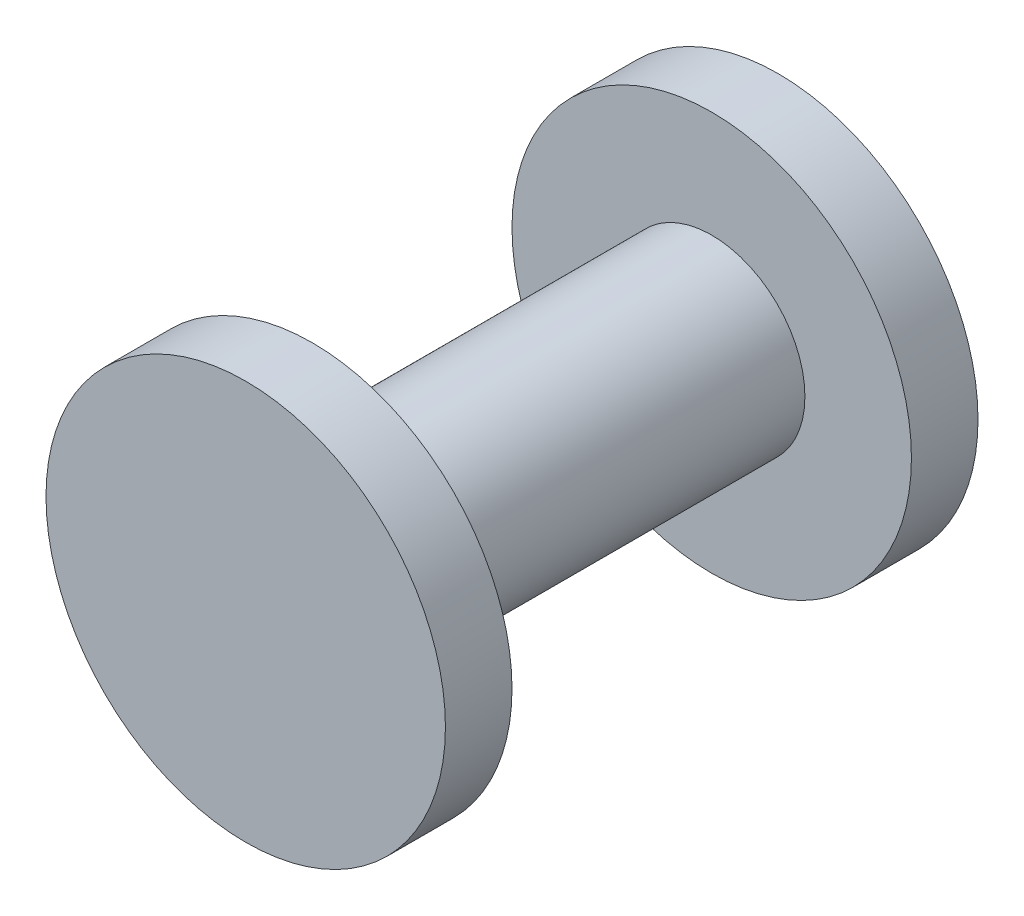
ISO-10303-21;
HEADER;
FILE_DESCRIPTION(('STEP AP214'),'2;1');
FILE_NAME('part.step','',(''),(''),'','','');
FILE_SCHEMA(('AUTOMOTIVE_DESIGN { 1 0 10303 214 1 1 1 1 }'));
ENDSEC;
DATA;
#1=APPLICATION_CONTEXT('core data for automotive mechanical design processes');
#2=APPLICATION_PROTOCOL_DEFINITION('international standard','automotive_design',2000,#1);
#3=PRODUCT_CONTEXT('',#1,'mechanical');
#4=PRODUCT('Part','Part','',(#3));
#5=PRODUCT_RELATED_PRODUCT_CATEGORY('part','',(#4));
#6=PRODUCT_DEFINITION_FORMATION('','',#4);
#7=PRODUCT_DEFINITION_CONTEXT('part definition',#1,'design');
#8=PRODUCT_DEFINITION('design','',#6,#7);
#9=PRODUCT_DEFINITION_SHAPE('','',#8);
#10=(LENGTH_UNIT() NAMED_UNIT(*) SI_UNIT(.MILLI.,.METRE.));
#11=(NAMED_UNIT(*) PLANE_ANGLE_UNIT() SI_UNIT($,.RADIAN.));
#12=(NAMED_UNIT(*) SI_UNIT($,.STERADIAN.) SOLID_ANGLE_UNIT());
#13=UNCERTAINTY_MEASURE_WITH_UNIT(LENGTH_MEASURE(1.E-05),#10,'distance_accuracy_value','');
#14=(GEOMETRIC_REPRESENTATION_CONTEXT(3) GLOBAL_UNCERTAINTY_ASSIGNED_CONTEXT((#13)) GLOBAL_UNIT_ASSIGNED_CONTEXT((#10,
#11,#12)) REPRESENTATION_CONTEXT('',''));
#15=CARTESIAN_POINT('',(0.,0.,0.));
#16=DIRECTION('',(0.,0.,1.));
#17=DIRECTION('',(1.,0.,0.));
#18=AXIS2_PLACEMENT_3D('',#15,#16,#17);
#19=CARTESIAN_POINT('',(0.,0.,0.));
#20=DIRECTION('',(0.,0.,1.));
#21=DIRECTION('',(1.,0.,0.));
#22=AXIS2_PLACEMENT_3D('',#19,#20,#21);
#23=CYLINDRICAL_SURFACE('',#22,14.);
#24=CARTESIAN_POINT('',(0.,0.,10.));
#25=DIRECTION('',(0.,0.,1.));
#26=DIRECTION('',(1.,0.,0.));
#27=AXIS2_PLACEMENT_3D('',#24,#25,#26);
#28=CIRCLE('',#27,14.);
#29=CARTESIAN_POINT('',(14.,0.,10.));
#30=VERTEX_POINT('',#29);
#31=EDGE_CURVE('E46',#30,#30,#28,.T.);
#32=ORIENTED_EDGE('',*,*,#31,.T.);
#33=EDGE_LOOP('',(#32));
#34=FACE_BOUND('',#33,.T.);
#35=CARTESIAN_POINT('',(0.,0.,70.));
#36=DIRECTION('',(0.,0.,1.));
#37=DIRECTION('',(1.,0.,0.));
#38=AXIS2_PLACEMENT_3D('',#35,#36,#37);
#39=CIRCLE('',#38,14.);
#40=CARTESIAN_POINT('',(14.,0.,70.));
#41=VERTEX_POINT('',#40);
#42=EDGE_CURVE('E54',#41,#41,#39,.T.);
#43=ORIENTED_EDGE('',*,*,#42,.F.);
#44=EDGE_LOOP('',(#43));
#45=FACE_BOUND('',#44,.T.);
#46=ADVANCED_FACE('F35',(#34,#45),#23,.T.);
#47=CARTESIAN_POINT('',(0.,0.,10.));
#48=DIRECTION('',(0.,0.,1.));
#49=DIRECTION('',(1.,0.,0.));
#50=AXIS2_PLACEMENT_3D('',#47,#48,#49);
#51=PLANE('',#50);
#52=CARTESIAN_POINT('',(0.,0.,10.));
#53=DIRECTION('',(0.,0.,1.));
#54=DIRECTION('',(1.,0.,0.));
#55=AXIS2_PLACEMENT_3D('',#52,#53,#54);
#56=CIRCLE('',#55,30.);
#57=CARTESIAN_POINT('',(30.,0.,10.));
#58=VERTEX_POINT('',#57);
#59=EDGE_CURVE('E10',#58,#58,#56,.T.);
#60=ORIENTED_EDGE('',*,*,#59,.T.);
#61=EDGE_LOOP('',(#60));
#62=FACE_BOUND('',#61,.T.);
#63=ORIENTED_EDGE('',*,*,#31,.F.);
#64=EDGE_LOOP('',(#63));
#65=FACE_BOUND('',#64,.T.);
#66=ADVANCED_FACE('F64',(#62,#65),#51,.T.);
#67=CARTESIAN_POINT('',(0.,0.,0.));
#68=DIRECTION('',(0.,0.,1.));
#69=DIRECTION('',(1.,0.,0.));
#70=AXIS2_PLACEMENT_3D('',#67,#68,#69);
#71=PLANE('',#70);
#72=CARTESIAN_POINT('',(0.,0.,0.));
#73=DIRECTION('',(0.,0.,1.));
#74=DIRECTION('',(1.,0.,0.));
#75=AXIS2_PLACEMENT_3D('',#72,#73,#74);
#76=CIRCLE('',#75,30.);
#77=CARTESIAN_POINT('',(30.,0.,0.));
#78=VERTEX_POINT('',#77);
#79=EDGE_CURVE('E39',#78,#78,#76,.T.);
#80=ORIENTED_EDGE('',*,*,#79,.F.);
#81=EDGE_LOOP('',(#80));
#82=FACE_BOUND('',#81,.T.);
#83=ADVANCED_FACE('F70',(#82),#71,.F.);
#84=CARTESIAN_POINT('',(0.,0.,10.));
#85=DIRECTION('',(0.,0.,-1.));
#86=DIRECTION('',(-1.,0.,0.));
#87=AXIS2_PLACEMENT_3D('',#84,#85,#86);
#88=CYLINDRICAL_SURFACE('',#87,30.);
#89=ORIENTED_EDGE('',*,*,#59,.F.);
#90=EDGE_LOOP('',(#89));
#91=FACE_BOUND('',#90,.T.);
#92=ORIENTED_EDGE('',*,*,#79,.T.);
#93=EDGE_LOOP('',(#92));
#94=FACE_BOUND('',#93,.T.);
#95=ADVANCED_FACE('F37',(#91,#94),#88,.T.);
#96=CARTESIAN_POINT('',(0.,0.,70.));
#97=DIRECTION('',(0.,0.,1.));
#98=DIRECTION('',(1.,0.,0.));
#99=AXIS2_PLACEMENT_3D('',#96,#97,#98);
#100=CYLINDRICAL_SURFACE('',#99,30.);
#101=CARTESIAN_POINT('',(0.,0.,70.));
#102=DIRECTION('',(0.,0.,1.));
#103=DIRECTION('',(1.,0.,0.));
#104=AXIS2_PLACEMENT_3D('',#101,#102,#103);
#105=CIRCLE('',#104,30.);
#106=CARTESIAN_POINT('',(30.,0.,70.));
#107=VERTEX_POINT('',#106);
#108=EDGE_CURVE('E50',#107,#107,#105,.T.);
#109=ORIENTED_EDGE('',*,*,#108,.T.);
#110=EDGE_LOOP('',(#109));
#111=FACE_BOUND('',#110,.T.);
#112=CARTESIAN_POINT('',(0.,0.,80.));
#113=DIRECTION('',(0.,0.,1.));
#114=DIRECTION('',(1.,0.,0.));
#115=AXIS2_PLACEMENT_3D('',#112,#113,#114);
#116=CIRCLE('',#115,30.);
#117=CARTESIAN_POINT('',(30.,0.,80.));
#118=VERTEX_POINT('',#117);
#119=EDGE_CURVE('E51',#118,#118,#116,.T.);
#120=ORIENTED_EDGE('',*,*,#119,.F.);
#121=EDGE_LOOP('',(#120));
#122=FACE_BOUND('',#121,.T.);
#123=ADVANCED_FACE('F80',(#111,#122),#100,.T.);
#124=CARTESIAN_POINT('',(0.,0.,70.));
#125=DIRECTION('',(0.,0.,1.));
#126=DIRECTION('',(1.,0.,0.));
#127=AXIS2_PLACEMENT_3D('',#124,#125,#126);
#128=PLANE('',#127);
#129=ORIENTED_EDGE('',*,*,#42,.T.);
#130=EDGE_LOOP('',(#129));
#131=FACE_BOUND('',#130,.T.);
#132=ORIENTED_EDGE('',*,*,#108,.F.);
#133=EDGE_LOOP('',(#132));
#134=FACE_BOUND('',#133,.T.);
#135=ADVANCED_FACE('F60',(#131,#134),#128,.F.);
#136=CARTESIAN_POINT('',(0.,0.,80.));
#137=DIRECTION('',(0.,0.,1.));
#138=DIRECTION('',(1.,0.,0.));
#139=AXIS2_PLACEMENT_3D('',#136,#137,#138);
#140=PLANE('',#139);
#141=ORIENTED_EDGE('',*,*,#119,.T.);
#142=EDGE_LOOP('',(#141));
#143=FACE_BOUND('',#142,.T.);
#144=ADVANCED_FACE('F73',(#143),#140,.T.);
#145=CLOSED_SHELL('',(#46,#66,#83,#95,#123,#135,#144));
#146=MANIFOLD_SOLID_BREP('B2',#145);
#147=ADVANCED_BREP_SHAPE_REPRESENTATION('',(#18,#146),#14);
#148=SHAPE_DEFINITION_REPRESENTATION(#9,#147);
ENDSEC;
END-ISO-10303-21;
